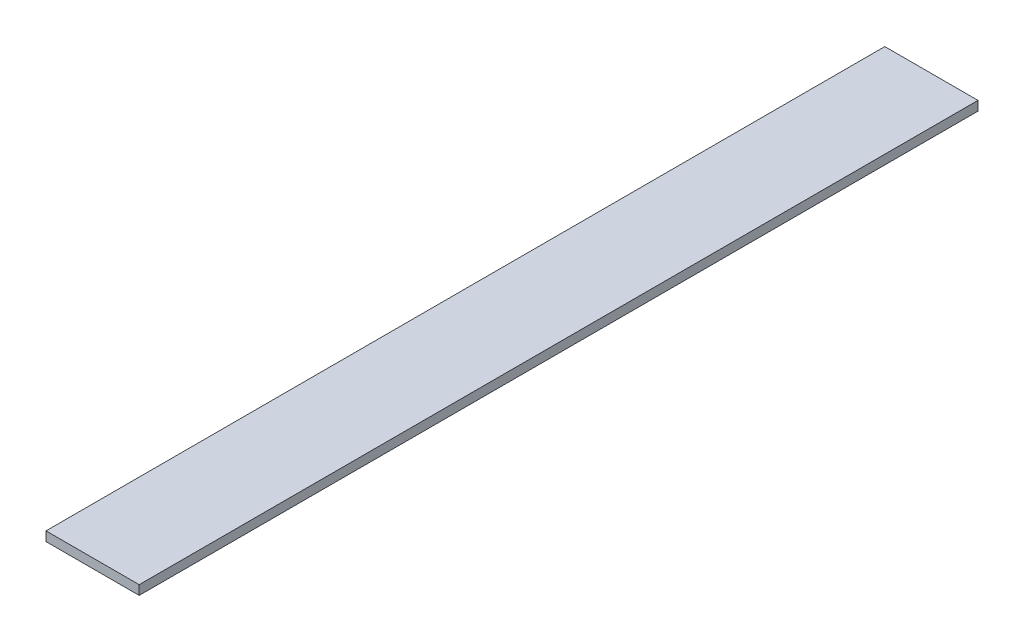
ISO-10303-21;
HEADER;
FILE_DESCRIPTION(('STEP AP214'),'2;1');
FILE_NAME('part.step','',(''),(''),'','','');
FILE_SCHEMA(('AUTOMOTIVE_DESIGN { 1 0 10303 214 1 1 1 1 }'));
ENDSEC;
DATA;
#1=APPLICATION_CONTEXT('core data for automotive mechanical design processes');
#2=APPLICATION_PROTOCOL_DEFINITION('international standard','automotive_design',2000,#1);
#3=PRODUCT_CONTEXT('',#1,'mechanical');
#4=PRODUCT('Part','Part','',(#3));
#5=PRODUCT_RELATED_PRODUCT_CATEGORY('part','',(#4));
#6=PRODUCT_DEFINITION_FORMATION('','',#4);
#7=PRODUCT_DEFINITION_CONTEXT('part definition',#1,'design');
#8=PRODUCT_DEFINITION('design','',#6,#7);
#9=PRODUCT_DEFINITION_SHAPE('','',#8);
#10=(LENGTH_UNIT() NAMED_UNIT(*) SI_UNIT(.MILLI.,.METRE.));
#11=(NAMED_UNIT(*) PLANE_ANGLE_UNIT() SI_UNIT($,.RADIAN.));
#12=(NAMED_UNIT(*) SI_UNIT($,.STERADIAN.) SOLID_ANGLE_UNIT());
#13=UNCERTAINTY_MEASURE_WITH_UNIT(LENGTH_MEASURE(1.E-05),#10,'distance_accuracy_value','');
#14=(GEOMETRIC_REPRESENTATION_CONTEXT(3) GLOBAL_UNCERTAINTY_ASSIGNED_CONTEXT((#13)) GLOBAL_UNIT_ASSIGNED_CONTEXT((#10,
#11,#12)) REPRESENTATION_CONTEXT('',''));
#15=CARTESIAN_POINT('',(0.,0.,0.));
#16=DIRECTION('',(0.,0.,1.));
#17=DIRECTION('',(1.,0.,0.));
#18=AXIS2_PLACEMENT_3D('',#15,#16,#17);
#19=CARTESIAN_POINT('',(-50.7999999999998,5.08,0.));
#20=DIRECTION('',(0.,0.,-1.));
#21=DIRECTION('',(-1.,0.,0.));
#22=AXIS2_PLACEMENT_3D('',#19,#20,#21);
#23=PLANE('',#22);
#24=DIRECTION('',(1.,0.,0.));
#25=VECTOR('',#24,1.);
#26=CARTESIAN_POINT('',(-50.7999999999998,0.,0.));
#27=LINE('',#26,#25);
#28=CARTESIAN_POINT('',(-50.7999999999998,0.,0.));
#29=VERTEX_POINT('',#28);
#30=CARTESIAN_POINT('',(0.,0.,0.));
#31=VERTEX_POINT('',#30);
#32=EDGE_CURVE('E100',#29,#31,#27,.T.);
#33=ORIENTED_EDGE('',*,*,#32,.T.);
#34=DIRECTION('',(0.,-1.,0.));
#35=VECTOR('',#34,1.);
#36=CARTESIAN_POINT('',(0.,5.08,0.));
#37=LINE('',#36,#35);
#38=CARTESIAN_POINT('',(0.,5.08,0.));
#39=VERTEX_POINT('',#38);
#40=EDGE_CURVE('E11',#39,#31,#37,.T.);
#41=ORIENTED_EDGE('',*,*,#40,.F.);
#42=DIRECTION('',(1.,0.,0.));
#43=VECTOR('',#42,1.);
#44=CARTESIAN_POINT('',(-50.7999999999998,5.08,0.));
#45=LINE('',#44,#43);
#46=CARTESIAN_POINT('',(-50.7999999999998,5.08,0.));
#47=VERTEX_POINT('',#46);
#48=EDGE_CURVE('E88',#47,#39,#45,.T.);
#49=ORIENTED_EDGE('',*,*,#48,.F.);
#50=DIRECTION('',(0.,-1.,0.));
#51=VECTOR('',#50,1.);
#52=CARTESIAN_POINT('',(-50.7999999999998,5.08,0.));
#53=LINE('',#52,#51);
#54=EDGE_CURVE('E96',#47,#29,#53,.T.);
#55=ORIENTED_EDGE('',*,*,#54,.T.);
#56=EDGE_LOOP('',(#33,#41,#49,#55));
#57=FACE_BOUND('',#56,.T.);
#58=ADVANCED_FACE('F37',(#57),#23,.F.);
#59=CARTESIAN_POINT('',(0.,5.08,0.));
#60=DIRECTION('',(-1.,0.,0.));
#61=DIRECTION('',(0.,0.,1.));
#62=AXIS2_PLACEMENT_3D('',#59,#60,#61);
#63=PLANE('',#62);
#64=DIRECTION('',(0.,0.,-1.));
#65=VECTOR('',#64,1.);
#66=CARTESIAN_POINT('',(0.,0.,0.));
#67=LINE('',#66,#65);
#68=CARTESIAN_POINT('',(0.,0.,-457.2));
#69=VERTEX_POINT('',#68);
#70=EDGE_CURVE('E92',#31,#69,#67,.T.);
#71=ORIENTED_EDGE('',*,*,#70,.T.);
#72=DIRECTION('',(0.,-1.,0.));
#73=VECTOR('',#72,1.);
#74=CARTESIAN_POINT('',(0.,5.08,-457.2));
#75=LINE('',#74,#73);
#76=CARTESIAN_POINT('',(0.,5.08,-457.2));
#77=VERTEX_POINT('',#76);
#78=EDGE_CURVE('E45',#77,#69,#75,.T.);
#79=ORIENTED_EDGE('',*,*,#78,.F.);
#80=DIRECTION('',(0.,0.,-1.));
#81=VECTOR('',#80,1.);
#82=CARTESIAN_POINT('',(0.,5.08,0.));
#83=LINE('',#82,#81);
#84=EDGE_CURVE('E83',#39,#77,#83,.T.);
#85=ORIENTED_EDGE('',*,*,#84,.F.);
#86=ORIENTED_EDGE('',*,*,#40,.T.);
#87=EDGE_LOOP('',(#71,#79,#85,#86));
#88=FACE_BOUND('',#87,.T.);
#89=ADVANCED_FACE('F91',(#88),#63,.F.);
#90=CARTESIAN_POINT('',(0.,5.08,-457.2));
#91=DIRECTION('',(0.,0.,1.));
#92=DIRECTION('',(1.,0.,0.));
#93=AXIS2_PLACEMENT_3D('',#90,#91,#92);
#94=PLANE('',#93);
#95=DIRECTION('',(-1.,0.,0.));
#96=VECTOR('',#95,1.);
#97=CARTESIAN_POINT('',(0.,0.,-457.2));
#98=LINE('',#97,#96);
#99=CARTESIAN_POINT('',(-50.8,0.,-457.2));
#100=VERTEX_POINT('',#99);
#101=EDGE_CURVE('E70',#69,#100,#98,.T.);
#102=ORIENTED_EDGE('',*,*,#101,.T.);
#103=DIRECTION('',(0.,-1.,0.));
#104=VECTOR('',#103,1.);
#105=CARTESIAN_POINT('',(-50.8,5.08,-457.2));
#106=LINE('',#105,#104);
#107=CARTESIAN_POINT('',(-50.8,5.08,-457.2));
#108=VERTEX_POINT('',#107);
#109=EDGE_CURVE('E93',#108,#100,#106,.T.);
#110=ORIENTED_EDGE('',*,*,#109,.F.);
#111=DIRECTION('',(-1.,0.,0.));
#112=VECTOR('',#111,1.);
#113=CARTESIAN_POINT('',(0.,5.08,-457.2));
#114=LINE('',#113,#112);
#115=EDGE_CURVE('E86',#77,#108,#114,.T.);
#116=ORIENTED_EDGE('',*,*,#115,.F.);
#117=ORIENTED_EDGE('',*,*,#78,.T.);
#118=EDGE_LOOP('',(#102,#110,#116,#117));
#119=FACE_BOUND('',#118,.T.);
#120=ADVANCED_FACE('F94',(#119),#94,.F.);
#121=CARTESIAN_POINT('',(-50.8,5.08,-457.2));
#122=DIRECTION('',(1.,0.,0.));
#123=DIRECTION('',(0.,0.,-1.));
#124=AXIS2_PLACEMENT_3D('',#121,#122,#123);
#125=PLANE('',#124);
#126=DIRECTION('',(0.,0.,1.));
#127=VECTOR('',#126,1.);
#128=CARTESIAN_POINT('',(-50.8,0.,-457.2));
#129=LINE('',#128,#127);
#130=EDGE_CURVE('E76',#100,#29,#129,.T.);
#131=ORIENTED_EDGE('',*,*,#130,.T.);
#132=ORIENTED_EDGE('',*,*,#54,.F.);
#133=DIRECTION('',(0.,0.,1.));
#134=VECTOR('',#133,1.);
#135=CARTESIAN_POINT('',(-50.8,5.08,-457.2));
#136=LINE('',#135,#134);
#137=EDGE_CURVE('E53',#108,#47,#136,.T.);
#138=ORIENTED_EDGE('',*,*,#137,.F.);
#139=ORIENTED_EDGE('',*,*,#109,.T.);
#140=EDGE_LOOP('',(#131,#132,#138,#139));
#141=FACE_BOUND('',#140,.T.);
#142=ADVANCED_FACE('F107',(#141),#125,.F.);
#143=CARTESIAN_POINT('',(0.,5.08,0.));
#144=DIRECTION('',(0.,1.,0.));
#145=DIRECTION('',(0.,0.,1.));
#146=AXIS2_PLACEMENT_3D('',#143,#144,#145);
#147=PLANE('',#146);
#148=ORIENTED_EDGE('',*,*,#48,.T.);
#149=ORIENTED_EDGE('',*,*,#84,.T.);
#150=ORIENTED_EDGE('',*,*,#115,.T.);
#151=ORIENTED_EDGE('',*,*,#137,.T.);
#152=EDGE_LOOP('',(#148,#149,#150,#151));
#153=FACE_BOUND('',#152,.T.);
#154=ADVANCED_FACE('F84',(#153),#147,.T.);
#155=CARTESIAN_POINT('',(0.,0.,0.));
#156=DIRECTION('',(0.,1.,0.));
#157=DIRECTION('',(0.,0.,1.));
#158=AXIS2_PLACEMENT_3D('',#155,#156,#157);
#159=PLANE('',#158);
#160=ORIENTED_EDGE('',*,*,#32,.F.);
#161=ORIENTED_EDGE('',*,*,#130,.F.);
#162=ORIENTED_EDGE('',*,*,#101,.F.);
#163=ORIENTED_EDGE('',*,*,#70,.F.);
#164=EDGE_LOOP('',(#160,#161,#162,#163));
#165=FACE_BOUND('',#164,.T.);
#166=ADVANCED_FACE('F110',(#165),#159,.F.);
#167=CLOSED_SHELL('',(#58,#89,#120,#142,#154,#166));
#168=MANIFOLD_SOLID_BREP('B2',#167);
#169=ADVANCED_BREP_SHAPE_REPRESENTATION('',(#18,#168),#14);
#170=SHAPE_DEFINITION_REPRESENTATION(#9,#169);
ENDSEC;
END-ISO-10303-21;
